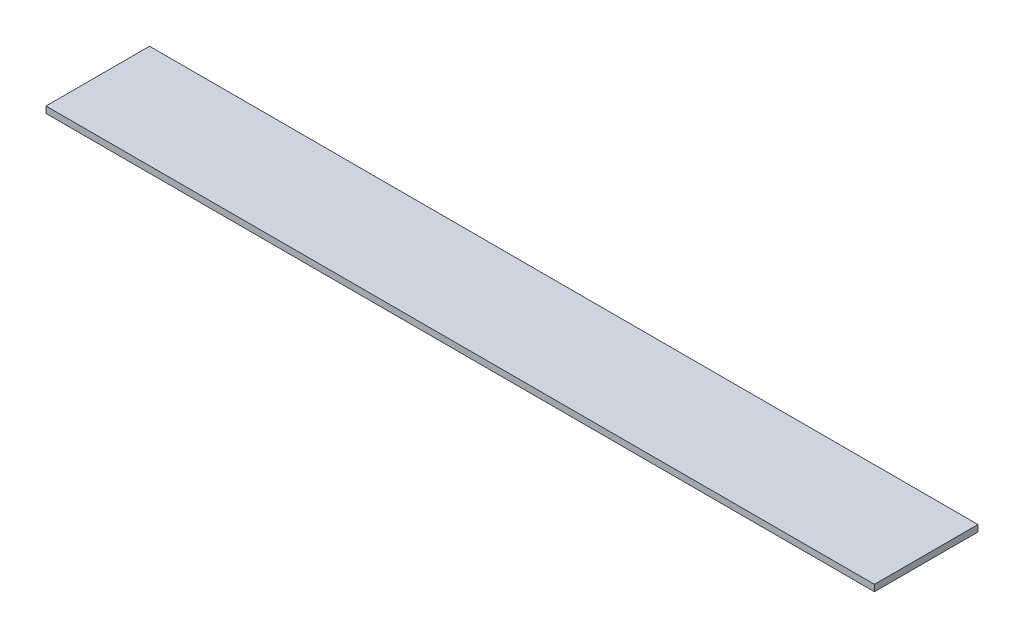
ISO-10303-21;
HEADER;
FILE_DESCRIPTION(('STEP AP214'),'2;1');
FILE_NAME('part.step','',(''),(''),'','','');
FILE_SCHEMA(('AUTOMOTIVE_DESIGN { 1 0 10303 214 1 1 1 1 }'));
ENDSEC;
DATA;
#1=APPLICATION_CONTEXT('core data for automotive mechanical design processes');
#2=APPLICATION_PROTOCOL_DEFINITION('international standard','automotive_design',2000,#1);
#3=PRODUCT_CONTEXT('',#1,'mechanical');
#4=PRODUCT('Part','Part','',(#3));
#5=PRODUCT_RELATED_PRODUCT_CATEGORY('part','',(#4));
#6=PRODUCT_DEFINITION_FORMATION('','',#4);
#7=PRODUCT_DEFINITION_CONTEXT('part definition',#1,'design');
#8=PRODUCT_DEFINITION('design','',#6,#7);
#9=PRODUCT_DEFINITION_SHAPE('','',#8);
#10=(LENGTH_UNIT() NAMED_UNIT(*) SI_UNIT(.MILLI.,.METRE.));
#11=(NAMED_UNIT(*) PLANE_ANGLE_UNIT() SI_UNIT($,.RADIAN.));
#12=(NAMED_UNIT(*) SI_UNIT($,.STERADIAN.) SOLID_ANGLE_UNIT());
#13=UNCERTAINTY_MEASURE_WITH_UNIT(LENGTH_MEASURE(1.E-05),#10,'distance_accuracy_value','');
#14=(GEOMETRIC_REPRESENTATION_CONTEXT(3) GLOBAL_UNCERTAINTY_ASSIGNED_CONTEXT((#13)) GLOBAL_UNIT_ASSIGNED_CONTEXT((#10,
#11,#12)) REPRESENTATION_CONTEXT('',''));
#15=CARTESIAN_POINT('',(0.,0.,0.));
#16=DIRECTION('',(0.,0.,1.));
#17=DIRECTION('',(1.,0.,0.));
#18=AXIS2_PLACEMENT_3D('',#15,#16,#17);
#19=CARTESIAN_POINT('',(0.,1.5875,0.));
#20=DIRECTION('',(1.,0.,0.));
#21=DIRECTION('',(0.,0.,-1.));
#22=AXIS2_PLACEMENT_3D('',#19,#20,#21);
#23=PLANE('',#22);
#24=DIRECTION('',(0.,0.,1.));
#25=VECTOR('',#24,1.);
#26=CARTESIAN_POINT('',(0.,0.,0.));
#27=LINE('',#26,#25);
#28=CARTESIAN_POINT('',(0.,0.,-25.4));
#29=VERTEX_POINT('',#28);
#30=CARTESIAN_POINT('',(0.,0.,0.));
#31=VERTEX_POINT('',#30);
#32=EDGE_CURVE('E96',#29,#31,#27,.T.);
#33=ORIENTED_EDGE('',*,*,#32,.T.);
#34=DIRECTION('',(0.,-1.,0.));
#35=VECTOR('',#34,1.);
#36=CARTESIAN_POINT('',(0.,1.5875,0.));
#37=LINE('',#36,#35);
#38=CARTESIAN_POINT('',(0.,1.5875,0.));
#39=VERTEX_POINT('',#38);
#40=EDGE_CURVE('E11',#39,#31,#37,.T.);
#41=ORIENTED_EDGE('',*,*,#40,.F.);
#42=DIRECTION('',(0.,0.,1.));
#43=VECTOR('',#42,1.);
#44=CARTESIAN_POINT('',(0.,1.5875,0.));
#45=LINE('',#44,#43);
#46=CARTESIAN_POINT('',(0.,1.5875,-25.4));
#47=VERTEX_POINT('',#46);
#48=EDGE_CURVE('E84',#47,#39,#45,.T.);
#49=ORIENTED_EDGE('',*,*,#48,.F.);
#50=DIRECTION('',(0.,-1.,0.));
#51=VECTOR('',#50,1.);
#52=CARTESIAN_POINT('',(0.,1.5875,-25.4));
#53=LINE('',#52,#51);
#54=EDGE_CURVE('E92',#47,#29,#53,.T.);
#55=ORIENTED_EDGE('',*,*,#54,.T.);
#56=EDGE_LOOP('',(#33,#41,#49,#55));
#57=FACE_BOUND('',#56,.T.);
#58=ADVANCED_FACE('F33',(#57),#23,.F.);
#59=CARTESIAN_POINT('',(0.,1.5875,0.));
#60=DIRECTION('',(0.,0.,-1.));
#61=DIRECTION('',(-1.,0.,0.));
#62=AXIS2_PLACEMENT_3D('',#59,#60,#61);
#63=PLANE('',#62);
#64=DIRECTION('',(1.,0.,0.));
#65=VECTOR('',#64,1.);
#66=CARTESIAN_POINT('',(0.,0.,0.));
#67=LINE('',#66,#65);
#68=CARTESIAN_POINT('',(203.2,0.,0.));
#69=VERTEX_POINT('',#68);
#70=EDGE_CURVE('E88',#31,#69,#67,.T.);
#71=ORIENTED_EDGE('',*,*,#70,.T.);
#72=DIRECTION('',(0.,-1.,0.));
#73=VECTOR('',#72,1.);
#74=CARTESIAN_POINT('',(203.2,1.5875,0.));
#75=LINE('',#74,#73);
#76=CARTESIAN_POINT('',(203.2,1.5875,0.));
#77=VERTEX_POINT('',#76);
#78=EDGE_CURVE('E41',#77,#69,#75,.T.);
#79=ORIENTED_EDGE('',*,*,#78,.F.);
#80=DIRECTION('',(1.,0.,0.));
#81=VECTOR('',#80,1.);
#82=CARTESIAN_POINT('',(0.,1.5875,0.));
#83=LINE('',#82,#81);
#84=EDGE_CURVE('E79',#39,#77,#83,.T.);
#85=ORIENTED_EDGE('',*,*,#84,.F.);
#86=ORIENTED_EDGE('',*,*,#40,.T.);
#87=EDGE_LOOP('',(#71,#79,#85,#86));
#88=FACE_BOUND('',#87,.T.);
#89=ADVANCED_FACE('F87',(#88),#63,.F.);
#90=CARTESIAN_POINT('',(203.2,1.5875,0.));
#91=DIRECTION('',(-1.,0.,0.));
#92=DIRECTION('',(0.,0.,1.));
#93=AXIS2_PLACEMENT_3D('',#90,#91,#92);
#94=PLANE('',#93);
#95=DIRECTION('',(0.,0.,-1.));
#96=VECTOR('',#95,1.);
#97=CARTESIAN_POINT('',(203.2,0.,0.));
#98=LINE('',#97,#96);
#99=CARTESIAN_POINT('',(203.2,0.,-25.4));
#100=VERTEX_POINT('',#99);
#101=EDGE_CURVE('E66',#69,#100,#98,.T.);
#102=ORIENTED_EDGE('',*,*,#101,.T.);
#103=DIRECTION('',(0.,-1.,0.));
#104=VECTOR('',#103,1.);
#105=CARTESIAN_POINT('',(203.2,1.5875,-25.4));
#106=LINE('',#105,#104);
#107=CARTESIAN_POINT('',(203.2,1.5875,-25.4));
#108=VERTEX_POINT('',#107);
#109=EDGE_CURVE('E89',#108,#100,#106,.T.);
#110=ORIENTED_EDGE('',*,*,#109,.F.);
#111=DIRECTION('',(0.,0.,-1.));
#112=VECTOR('',#111,1.);
#113=CARTESIAN_POINT('',(203.2,1.5875,0.));
#114=LINE('',#113,#112);
#115=EDGE_CURVE('E82',#77,#108,#114,.T.);
#116=ORIENTED_EDGE('',*,*,#115,.F.);
#117=ORIENTED_EDGE('',*,*,#78,.T.);
#118=EDGE_LOOP('',(#102,#110,#116,#117));
#119=FACE_BOUND('',#118,.T.);
#120=ADVANCED_FACE('F90',(#119),#94,.F.);
#121=CARTESIAN_POINT('',(0.,1.5875,-25.4));
#122=DIRECTION('',(0.,0.,1.));
#123=DIRECTION('',(1.,0.,0.));
#124=AXIS2_PLACEMENT_3D('',#121,#122,#123);
#125=PLANE('',#124);
#126=DIRECTION('',(-1.,0.,0.));
#127=VECTOR('',#126,1.);
#128=CARTESIAN_POINT('',(0.,0.,-25.4));
#129=LINE('',#128,#127);
#130=EDGE_CURVE('E72',#100,#29,#129,.T.);
#131=ORIENTED_EDGE('',*,*,#130,.T.);
#132=ORIENTED_EDGE('',*,*,#54,.F.);
#133=DIRECTION('',(-1.,0.,0.));
#134=VECTOR('',#133,1.);
#135=CARTESIAN_POINT('',(0.,1.5875,-25.4));
#136=LINE('',#135,#134);
#137=EDGE_CURVE('E49',#108,#47,#136,.T.);
#138=ORIENTED_EDGE('',*,*,#137,.F.);
#139=ORIENTED_EDGE('',*,*,#109,.T.);
#140=EDGE_LOOP('',(#131,#132,#138,#139));
#141=FACE_BOUND('',#140,.T.);
#142=ADVANCED_FACE('F103',(#141),#125,.F.);
#143=CARTESIAN_POINT('',(0.,1.5875,0.));
#144=DIRECTION('',(0.,-1.,0.));
#145=DIRECTION('',(0.,0.,-1.));
#146=AXIS2_PLACEMENT_3D('',#143,#144,#145);
#147=PLANE('',#146);
#148=ORIENTED_EDGE('',*,*,#48,.T.);
#149=ORIENTED_EDGE('',*,*,#84,.T.);
#150=ORIENTED_EDGE('',*,*,#115,.T.);
#151=ORIENTED_EDGE('',*,*,#137,.T.);
#152=EDGE_LOOP('',(#148,#149,#150,#151));
#153=FACE_BOUND('',#152,.T.);
#154=ADVANCED_FACE('F80',(#153),#147,.F.);
#155=CARTESIAN_POINT('',(0.,0.,0.));
#156=DIRECTION('',(0.,-1.,0.));
#157=DIRECTION('',(0.,0.,-1.));
#158=AXIS2_PLACEMENT_3D('',#155,#156,#157);
#159=PLANE('',#158);
#160=ORIENTED_EDGE('',*,*,#32,.F.);
#161=ORIENTED_EDGE('',*,*,#130,.F.);
#162=ORIENTED_EDGE('',*,*,#101,.F.);
#163=ORIENTED_EDGE('',*,*,#70,.F.);
#164=EDGE_LOOP('',(#160,#161,#162,#163));
#165=FACE_BOUND('',#164,.T.);
#166=ADVANCED_FACE('F106',(#165),#159,.T.);
#167=CLOSED_SHELL('',(#58,#89,#120,#142,#154,#166));
#168=MANIFOLD_SOLID_BREP('B2',#167);
#169=ADVANCED_BREP_SHAPE_REPRESENTATION('',(#18,#168),#14);
#170=SHAPE_DEFINITION_REPRESENTATION(#9,#169);
ENDSEC;
END-ISO-10303-21;
